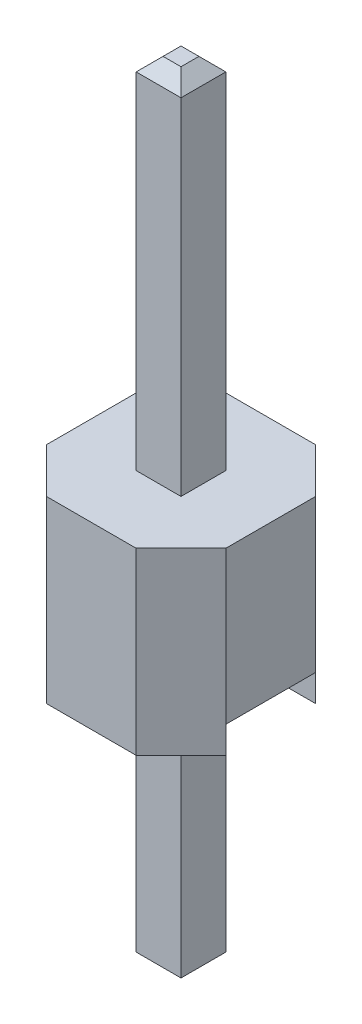
ISO-10303-21;
HEADER;
FILE_DESCRIPTION(('STEP AP214'),'2;1');
FILE_NAME('part.step','',(''),(''),'','','');
FILE_SCHEMA(('AUTOMOTIVE_DESIGN { 1 0 10303 214 1 1 1 1 }'));
ENDSEC;
DATA;
#1=APPLICATION_CONTEXT('core data for automotive mechanical design processes');
#2=APPLICATION_PROTOCOL_DEFINITION('international standard','automotive_design',2000,#1);
#3=PRODUCT_CONTEXT('',#1,'mechanical');
#4=PRODUCT('Part','Part','',(#3));
#5=PRODUCT_RELATED_PRODUCT_CATEGORY('part','',(#4));
#6=PRODUCT_DEFINITION_FORMATION('','',#4);
#7=PRODUCT_DEFINITION_CONTEXT('part definition',#1,'design');
#8=PRODUCT_DEFINITION('design','',#6,#7);
#9=PRODUCT_DEFINITION_SHAPE('','',#8);
#10=(LENGTH_UNIT() NAMED_UNIT(*) SI_UNIT(.MILLI.,.METRE.));
#11=(NAMED_UNIT(*) PLANE_ANGLE_UNIT() SI_UNIT($,.RADIAN.));
#12=(NAMED_UNIT(*) SI_UNIT($,.STERADIAN.) SOLID_ANGLE_UNIT());
#13=UNCERTAINTY_MEASURE_WITH_UNIT(LENGTH_MEASURE(1.E-05),#10,'distance_accuracy_value','');
#14=(GEOMETRIC_REPRESENTATION_CONTEXT(3) GLOBAL_UNCERTAINTY_ASSIGNED_CONTEXT((#13)) GLOBAL_UNIT_ASSIGNED_CONTEXT((#10,
#11,#12)) REPRESENTATION_CONTEXT('',''));
#15=CARTESIAN_POINT('',(0.,0.,0.));
#16=DIRECTION('',(0.,0.,1.));
#17=DIRECTION('',(1.,0.,0.));
#18=AXIS2_PLACEMENT_3D('',#15,#16,#17);
#19=CARTESIAN_POINT('',(-2.59591892663164,0.381,0.634999999999996));
#20=DIRECTION('',(0.,1.,0.));
#21=DIRECTION('',(0.,0.,1.));
#22=AXIS2_PLACEMENT_3D('',#19,#20,#21);
#23=PLANE('',#22);
#24=DIRECTION('',(0.,0.,-1.));
#25=VECTOR('',#24,1.);
#26=CARTESIAN_POINT('',(-1.27,0.381,0.635000000000008));
#27=LINE('',#26,#25);
#28=CARTESIAN_POINT('',(-1.27,0.381,0.634999999999998));
#29=VERTEX_POINT('',#28);
#30=CARTESIAN_POINT('',(-1.26999999999999,0.381,-0.635000000000004));
#31=VERTEX_POINT('',#30);
#32=EDGE_CURVE('E239',#29,#31,#27,.T.);
#33=ORIENTED_EDGE('',*,*,#32,.T.);
#34=DIRECTION('',(1.,0.,0.));
#35=VECTOR('',#34,1.);
#36=CARTESIAN_POINT('',(-2.59591892663164,0.381,-0.635000000000004));
#37=LINE('',#36,#35);
#38=CARTESIAN_POINT('',(1.27,0.381,-0.634999999999998));
#39=VERTEX_POINT('',#38);
#40=EDGE_CURVE('E247',#31,#39,#37,.T.);
#41=ORIENTED_EDGE('',*,*,#40,.T.);
#42=DIRECTION('',(0.,0.,1.));
#43=VECTOR('',#42,1.);
#44=CARTESIAN_POINT('',(1.27,0.381,0.635000000000002));
#45=LINE('',#44,#43);
#46=CARTESIAN_POINT('',(1.27,0.381,0.635000000000002));
#47=VERTEX_POINT('',#46);
#48=EDGE_CURVE('E242',#39,#47,#45,.T.);
#49=ORIENTED_EDGE('',*,*,#48,.T.);
#50=DIRECTION('',(1.,0.,0.));
#51=VECTOR('',#50,1.);
#52=CARTESIAN_POINT('',(-2.59591892663164,0.381,0.634999999999996));
#53=LINE('',#52,#51);
#54=EDGE_CURVE('E252',#29,#47,#53,.T.);
#55=ORIENTED_EDGE('',*,*,#54,.F.);
#56=EDGE_LOOP('',(#33,#41,#49,#55));
#57=FACE_BOUND('',#56,.T.);
#58=DIRECTION('',(0.,0.,1.));
#59=VECTOR('',#58,1.);
#60=CARTESIAN_POINT('',(0.3175,0.381,-0.3175));
#61=LINE('',#60,#59);
#62=CARTESIAN_POINT('',(0.3175,0.381,-0.3175));
#63=VERTEX_POINT('',#62);
#64=CARTESIAN_POINT('',(0.3175,0.381,0.3175));
#65=VERTEX_POINT('',#64);
#66=EDGE_CURVE('E184',#63,#65,#61,.T.);
#67=ORIENTED_EDGE('',*,*,#66,.F.);
#68=DIRECTION('',(1.,0.,0.));
#69=VECTOR('',#68,1.);
#70=CARTESIAN_POINT('',(-0.3175,0.381,-0.3175));
#71=LINE('',#70,#69);
#72=CARTESIAN_POINT('',(-0.3175,0.381,-0.3175));
#73=VERTEX_POINT('',#72);
#74=EDGE_CURVE('E189',#73,#63,#71,.T.);
#75=ORIENTED_EDGE('',*,*,#74,.F.);
#76=DIRECTION('',(0.,0.,-1.));
#77=VECTOR('',#76,1.);
#78=CARTESIAN_POINT('',(-0.3175,0.381,-0.3175));
#79=LINE('',#78,#77);
#80=CARTESIAN_POINT('',(-0.3175,0.381,0.3175));
#81=VERTEX_POINT('',#80);
#82=EDGE_CURVE('E201',#81,#73,#79,.T.);
#83=ORIENTED_EDGE('',*,*,#82,.F.);
#84=DIRECTION('',(-1.,0.,0.));
#85=VECTOR('',#84,1.);
#86=CARTESIAN_POINT('',(-0.3175,0.381,0.3175));
#87=LINE('',#86,#85);
#88=EDGE_CURVE('E197',#65,#81,#87,.T.);
#89=ORIENTED_EDGE('',*,*,#88,.F.);
#90=EDGE_LOOP('',(#67,#75,#83,#89));
#91=FACE_BOUND('',#90,.T.);
#92=ADVANCED_FACE('F34',(#57,#91),#23,.F.);
#93=CARTESIAN_POINT('',(0.,2.54,0.));
#94=DIRECTION('',(0.,1.,0.));
#95=DIRECTION('',(0.,0.,1.));
#96=AXIS2_PLACEMENT_3D('',#93,#94,#95);
#97=PLANE('',#96);
#98=DIRECTION('',(-1.,0.,0.));
#99=VECTOR('',#98,1.);
#100=CARTESIAN_POINT('',(-0.634999999999986,2.54,-1.27000000000001));
#101=LINE('',#100,#99);
#102=CARTESIAN_POINT('',(0.634999999999999,2.54,-1.27));
#103=VERTEX_POINT('',#102);
#104=CARTESIAN_POINT('',(-0.634999999999986,2.54,-1.27000000000001));
#105=VERTEX_POINT('',#104);
#106=EDGE_CURVE('E257',#103,#105,#101,.T.);
#107=ORIENTED_EDGE('',*,*,#106,.T.);
#108=DIRECTION('',(-0.707106781186555,0.,0.70710678118654));
#109=VECTOR('',#108,1.);
#110=CARTESIAN_POINT('',(-1.26999999999999,2.54,-0.635000000000013));
#111=LINE('',#110,#109);
#112=CARTESIAN_POINT('',(-1.26999999999999,2.54,-0.635000000000013));
#113=VERTEX_POINT('',#112);
#114=EDGE_CURVE('E260',#105,#113,#111,.T.);
#115=ORIENTED_EDGE('',*,*,#114,.T.);
#116=DIRECTION('',(0.,0.,1.));
#117=VECTOR('',#116,1.);
#118=CARTESIAN_POINT('',(-1.27,2.54,0.63499999999999));
#119=LINE('',#118,#117);
#120=CARTESIAN_POINT('',(-1.27,2.54,0.63499999999999));
#121=VERTEX_POINT('',#120);
#122=EDGE_CURVE('E263',#113,#121,#119,.T.);
#123=ORIENTED_EDGE('',*,*,#122,.T.);
#124=DIRECTION('',(0.707106781186542,0.,0.707106781186553));
#125=VECTOR('',#124,1.);
#126=CARTESIAN_POINT('',(-0.635000000000008,2.54,1.27));
#127=LINE('',#126,#125);
#128=CARTESIAN_POINT('',(-0.635000000000008,2.54,1.27));
#129=VERTEX_POINT('',#128);
#130=EDGE_CURVE('E265',#121,#129,#127,.T.);
#131=ORIENTED_EDGE('',*,*,#130,.T.);
#132=DIRECTION('',(1.,0.,0.));
#133=VECTOR('',#132,1.);
#134=CARTESIAN_POINT('',(-0.635000000000008,2.54,1.27));
#135=LINE('',#134,#133);
#136=CARTESIAN_POINT('',(0.634999999999995,2.54,1.27));
#137=VERTEX_POINT('',#136);
#138=EDGE_CURVE('E267',#129,#137,#135,.T.);
#139=ORIENTED_EDGE('',*,*,#138,.T.);
#140=DIRECTION('',(0.70710678118655,0.,-0.707106781186545));
#141=VECTOR('',#140,1.);
#142=CARTESIAN_POINT('',(1.27,2.54,0.635000000000004));
#143=LINE('',#142,#141);
#144=CARTESIAN_POINT('',(1.27,2.54,0.635000000000004));
#145=VERTEX_POINT('',#144);
#146=EDGE_CURVE('E269',#137,#145,#143,.T.);
#147=ORIENTED_EDGE('',*,*,#146,.T.);
#148=DIRECTION('',(0.,0.,-1.));
#149=VECTOR('',#148,1.);
#150=CARTESIAN_POINT('',(1.27,2.54,0.635000000000004));
#151=LINE('',#150,#149);
#152=CARTESIAN_POINT('',(1.27,2.54,-0.634999999999999));
#153=VERTEX_POINT('',#152);
#154=EDGE_CURVE('E271',#145,#153,#151,.T.);
#155=ORIENTED_EDGE('',*,*,#154,.T.);
#156=DIRECTION('',(-0.707106781186548,0.,-0.707106781186548));
#157=VECTOR('',#156,1.);
#158=CARTESIAN_POINT('',(0.634999999999999,2.54,-1.27));
#159=LINE('',#158,#157);
#160=EDGE_CURVE('E273',#153,#103,#159,.T.);
#161=ORIENTED_EDGE('',*,*,#160,.T.);
#162=EDGE_LOOP('',(#107,#115,#123,#131,#139,#147,#155,#161));
#163=FACE_BOUND('',#162,.T.);
#164=DIRECTION('',(-1.,0.,0.));
#165=VECTOR('',#164,1.);
#166=CARTESIAN_POINT('',(-0.3175,2.54,-0.3175));
#167=LINE('',#166,#165);
#168=CARTESIAN_POINT('',(0.3175,2.54,-0.3175));
#169=VERTEX_POINT('',#168);
#170=CARTESIAN_POINT('',(-0.3175,2.54,-0.3175));
#171=VERTEX_POINT('',#170);
#172=EDGE_CURVE('E215',#169,#171,#167,.T.);
#173=ORIENTED_EDGE('',*,*,#172,.F.);
#174=DIRECTION('',(0.,0.,-1.));
#175=VECTOR('',#174,1.);
#176=CARTESIAN_POINT('',(0.3175,2.54,0.3175));
#177=LINE('',#176,#175);
#178=CARTESIAN_POINT('',(0.3175,2.54,0.3175));
#179=VERTEX_POINT('',#178);
#180=EDGE_CURVE('E212',#179,#169,#177,.T.);
#181=ORIENTED_EDGE('',*,*,#180,.F.);
#182=DIRECTION('',(1.,0.,0.));
#183=VECTOR('',#182,1.);
#184=CARTESIAN_POINT('',(-0.3175,2.54,0.3175));
#185=LINE('',#184,#183);
#186=CARTESIAN_POINT('',(-0.3175,2.54,0.3175));
#187=VERTEX_POINT('',#186);
#188=EDGE_CURVE('E222',#187,#179,#185,.T.);
#189=ORIENTED_EDGE('',*,*,#188,.F.);
#190=DIRECTION('',(0.,0.,1.));
#191=VECTOR('',#190,1.);
#192=CARTESIAN_POINT('',(-0.3175,2.54,0.3175));
#193=LINE('',#192,#191);
#194=EDGE_CURVE('E219',#171,#187,#193,.T.);
#195=ORIENTED_EDGE('',*,*,#194,.F.);
#196=EDGE_LOOP('',(#173,#181,#189,#195));
#197=FACE_BOUND('',#196,.T.);
#198=ADVANCED_FACE('F387',(#163,#197),#97,.T.);
#199=CARTESIAN_POINT('',(0.,0.,0.));
#200=DIRECTION('',(0.,1.,0.));
#201=DIRECTION('',(0.,0.,1.));
#202=AXIS2_PLACEMENT_3D('',#199,#200,#201);
#203=PLANE('',#202);
#204=DIRECTION('',(-0.707106781186548,0.,-0.707106781186548));
#205=VECTOR('',#204,1.);
#206=CARTESIAN_POINT('',(0.634999999999999,0.,-1.27));
#207=LINE('',#206,#205);
#208=CARTESIAN_POINT('',(1.27,0.,-0.634999999999999));
#209=VERTEX_POINT('',#208);
#210=CARTESIAN_POINT('',(0.634999999999999,0.,-1.27));
#211=VERTEX_POINT('',#210);
#212=EDGE_CURVE('E261',#209,#211,#207,.T.);
#213=ORIENTED_EDGE('',*,*,#212,.F.);
#214=DIRECTION('',(1.,0.,0.));
#215=VECTOR('',#214,1.);
#216=CARTESIAN_POINT('',(-2.59591892663164,0.,-0.635000000000005));
#217=LINE('',#216,#215);
#218=CARTESIAN_POINT('',(-1.26999999999999,0.,-0.635000000000006));
#219=VERTEX_POINT('',#218);
#220=EDGE_CURVE('E237',#219,#209,#217,.T.);
#221=ORIENTED_EDGE('',*,*,#220,.F.);
#222=DIRECTION('',(-0.707106781186555,0.,0.70710678118654));
#223=VECTOR('',#222,1.);
#224=CARTESIAN_POINT('',(-1.26999999999999,0.,-0.635000000000013));
#225=LINE('',#224,#223);
#226=CARTESIAN_POINT('',(-0.634999999999986,0.,-1.27000000000001));
#227=VERTEX_POINT('',#226);
#228=EDGE_CURVE('E278',#227,#219,#225,.T.);
#229=ORIENTED_EDGE('',*,*,#228,.F.);
#230=DIRECTION('',(-1.,0.,0.));
#231=VECTOR('',#230,1.);
#232=CARTESIAN_POINT('',(-0.634999999999986,0.,-1.27000000000001));
#233=LINE('',#232,#231);
#234=EDGE_CURVE('E256',#211,#227,#233,.T.);
#235=ORIENTED_EDGE('',*,*,#234,.F.);
#236=EDGE_LOOP('',(#213,#221,#229,#235));
#237=FACE_BOUND('',#236,.T.);
#238=ADVANCED_FACE('F393',(#237),#203,.F.);
#239=CARTESIAN_POINT('',(-0.634999999999986,2.54,-1.27000000000001));
#240=DIRECTION('',(0.,0.,1.));
#241=DIRECTION('',(1.,0.,0.));
#242=AXIS2_PLACEMENT_3D('',#239,#240,#241);
#243=PLANE('',#242);
#244=ORIENTED_EDGE('',*,*,#234,.T.);
#245=DIRECTION('',(0.,-1.,0.));
#246=VECTOR('',#245,1.);
#247=CARTESIAN_POINT('',(-0.634999999999986,2.54,-1.27000000000001));
#248=LINE('',#247,#246);
#249=EDGE_CURVE('E309',#105,#227,#248,.T.);
#250=ORIENTED_EDGE('',*,*,#249,.F.);
#251=ORIENTED_EDGE('',*,*,#106,.F.);
#252=DIRECTION('',(0.,-1.,0.));
#253=VECTOR('',#252,1.);
#254=CARTESIAN_POINT('',(0.634999999999999,2.54,-1.27));
#255=LINE('',#254,#253);
#256=EDGE_CURVE('E275',#103,#211,#255,.T.);
#257=ORIENTED_EDGE('',*,*,#256,.T.);
#258=EDGE_LOOP('',(#244,#250,#251,#257));
#259=FACE_BOUND('',#258,.T.);
#260=ADVANCED_FACE('F435',(#259),#243,.F.);
#261=CARTESIAN_POINT('',(-1.26999999999999,2.54,-0.635000000000013));
#262=DIRECTION('',(0.70710678118654,0.,0.707106781186555));
#263=DIRECTION('',(0.707106781186555,0.,-0.70710678118654));
#264=AXIS2_PLACEMENT_3D('',#261,#262,#263);
#265=PLANE('',#264);
#266=ORIENTED_EDGE('',*,*,#228,.T.);
#267=DIRECTION('',(0.,-1.,0.));
#268=VECTOR('',#267,1.);
#269=CARTESIAN_POINT('',(-1.26999999999999,0.,-0.635000000000003));
#270=LINE('',#269,#268);
#271=EDGE_CURVE('E236',#31,#219,#270,.T.);
#272=ORIENTED_EDGE('',*,*,#271,.F.);
#273=DIRECTION('',(0.,-1.,0.));
#274=VECTOR('',#273,1.);
#275=CARTESIAN_POINT('',(-1.26999999999999,2.54,-0.635000000000013));
#276=LINE('',#275,#274);
#277=EDGE_CURVE('E306',#113,#31,#276,.T.);
#278=ORIENTED_EDGE('',*,*,#277,.F.);
#279=ORIENTED_EDGE('',*,*,#114,.F.);
#280=ORIENTED_EDGE('',*,*,#249,.T.);
#281=EDGE_LOOP('',(#266,#272,#278,#279,#280));
#282=FACE_BOUND('',#281,.T.);
#283=ADVANCED_FACE('F431',(#282),#265,.F.);
#284=CARTESIAN_POINT('',(-1.27,2.54,0.63499999999999));
#285=DIRECTION('',(1.,0.,0.));
#286=DIRECTION('',(0.,0.,-1.));
#287=AXIS2_PLACEMENT_3D('',#284,#285,#286);
#288=PLANE('',#287);
#289=ORIENTED_EDGE('',*,*,#277,.T.);
#290=ORIENTED_EDGE('',*,*,#32,.F.);
#291=DIRECTION('',(0.,-1.,0.));
#292=VECTOR('',#291,1.);
#293=CARTESIAN_POINT('',(-1.27,2.54,0.63499999999999));
#294=LINE('',#293,#292);
#295=EDGE_CURVE('E303',#121,#29,#294,.T.);
#296=ORIENTED_EDGE('',*,*,#295,.F.);
#297=ORIENTED_EDGE('',*,*,#122,.F.);
#298=EDGE_LOOP('',(#289,#290,#296,#297));
#299=FACE_BOUND('',#298,.T.);
#300=ADVANCED_FACE('F427',(#299),#288,.F.);
#301=CARTESIAN_POINT('',(-0.635000000000008,2.54,1.27));
#302=DIRECTION('',(0.707106781186553,0.,-0.707106781186542));
#303=DIRECTION('',(-0.707106781186542,0.,-0.707106781186553));
#304=AXIS2_PLACEMENT_3D('',#301,#302,#303);
#305=PLANE('',#304);
#306=DIRECTION('',(0.707106781186542,0.,0.707106781186553));
#307=VECTOR('',#306,1.);
#308=CARTESIAN_POINT('',(-0.635000000000008,0.,1.27));
#309=LINE('',#308,#307);
#310=CARTESIAN_POINT('',(-1.27,0.,0.635));
#311=VERTEX_POINT('',#310);
#312=CARTESIAN_POINT('',(-0.635000000000008,0.,1.27));
#313=VERTEX_POINT('',#312);
#314=EDGE_CURVE('E281',#311,#313,#309,.T.);
#315=ORIENTED_EDGE('',*,*,#314,.T.);
#316=DIRECTION('',(0.,-1.,0.));
#317=VECTOR('',#316,1.);
#318=CARTESIAN_POINT('',(-0.635000000000008,2.54,1.27));
#319=LINE('',#318,#317);
#320=EDGE_CURVE('E300',#129,#313,#319,.T.);
#321=ORIENTED_EDGE('',*,*,#320,.F.);
#322=ORIENTED_EDGE('',*,*,#130,.F.);
#323=ORIENTED_EDGE('',*,*,#295,.T.);
#324=DIRECTION('',(0.,1.,0.));
#325=VECTOR('',#324,1.);
#326=CARTESIAN_POINT('',(-1.27,0.,0.635));
#327=LINE('',#326,#325);
#328=EDGE_CURVE('E234',#311,#29,#327,.T.);
#329=ORIENTED_EDGE('',*,*,#328,.F.);
#330=EDGE_LOOP('',(#315,#321,#322,#323,#329));
#331=FACE_BOUND('',#330,.T.);
#332=ADVANCED_FACE('F423',(#331),#305,.F.);
#333=CARTESIAN_POINT('',(-0.635000000000008,2.54,1.27));
#334=DIRECTION('',(0.,0.,-1.));
#335=DIRECTION('',(-1.,0.,0.));
#336=AXIS2_PLACEMENT_3D('',#333,#334,#335);
#337=PLANE('',#336);
#338=DIRECTION('',(1.,0.,0.));
#339=VECTOR('',#338,1.);
#340=CARTESIAN_POINT('',(-0.635000000000008,0.,1.27));
#341=LINE('',#340,#339);
#342=CARTESIAN_POINT('',(0.634999999999995,0.,1.27));
#343=VERTEX_POINT('',#342);
#344=EDGE_CURVE('E283',#313,#343,#341,.T.);
#345=ORIENTED_EDGE('',*,*,#344,.T.);
#346=DIRECTION('',(0.,-1.,0.));
#347=VECTOR('',#346,1.);
#348=CARTESIAN_POINT('',(0.634999999999995,2.54,1.27));
#349=LINE('',#348,#347);
#350=EDGE_CURVE('E297',#137,#343,#349,.T.);
#351=ORIENTED_EDGE('',*,*,#350,.F.);
#352=ORIENTED_EDGE('',*,*,#138,.F.);
#353=ORIENTED_EDGE('',*,*,#320,.T.);
#354=EDGE_LOOP('',(#345,#351,#352,#353));
#355=FACE_BOUND('',#354,.T.);
#356=ADVANCED_FACE('F419',(#355),#337,.F.);
#357=CARTESIAN_POINT('',(1.27,2.54,0.635000000000004));
#358=DIRECTION('',(-0.707106781186545,0.,-0.70710678118655));
#359=DIRECTION('',(-0.70710678118655,0.,0.707106781186545));
#360=AXIS2_PLACEMENT_3D('',#357,#358,#359);
#361=PLANE('',#360);
#362=DIRECTION('',(0.70710678118655,0.,-0.707106781186545));
#363=VECTOR('',#362,1.);
#364=CARTESIAN_POINT('',(1.27,0.,0.635000000000004));
#365=LINE('',#364,#363);
#366=CARTESIAN_POINT('',(1.27,0.,0.635000000000004));
#367=VERTEX_POINT('',#366);
#368=EDGE_CURVE('E285',#343,#367,#365,.T.);
#369=ORIENTED_EDGE('',*,*,#368,.T.);
#370=DIRECTION('',(0.,-1.,0.));
#371=VECTOR('',#370,1.);
#372=CARTESIAN_POINT('',(1.27,0.,0.635000000000004));
#373=LINE('',#372,#371);
#374=EDGE_CURVE('E245',#47,#367,#373,.T.);
#375=ORIENTED_EDGE('',*,*,#374,.F.);
#376=DIRECTION('',(0.,-1.,0.));
#377=VECTOR('',#376,1.);
#378=CARTESIAN_POINT('',(1.27,2.54,0.635000000000004));
#379=LINE('',#378,#377);
#380=EDGE_CURVE('E294',#145,#47,#379,.T.);
#381=ORIENTED_EDGE('',*,*,#380,.F.);
#382=ORIENTED_EDGE('',*,*,#146,.F.);
#383=ORIENTED_EDGE('',*,*,#350,.T.);
#384=EDGE_LOOP('',(#369,#375,#381,#382,#383));
#385=FACE_BOUND('',#384,.T.);
#386=ADVANCED_FACE('F415',(#385),#361,.F.);
#387=CARTESIAN_POINT('',(1.27,2.54,0.635000000000004));
#388=DIRECTION('',(-1.,0.,0.));
#389=DIRECTION('',(0.,0.,1.));
#390=AXIS2_PLACEMENT_3D('',#387,#388,#389);
#391=PLANE('',#390);
#392=ORIENTED_EDGE('',*,*,#380,.T.);
#393=ORIENTED_EDGE('',*,*,#48,.F.);
#394=DIRECTION('',(0.,-1.,0.));
#395=VECTOR('',#394,1.);
#396=CARTESIAN_POINT('',(1.27,2.54,-0.634999999999999));
#397=LINE('',#396,#395);
#398=EDGE_CURVE('E291',#153,#39,#397,.T.);
#399=ORIENTED_EDGE('',*,*,#398,.F.);
#400=ORIENTED_EDGE('',*,*,#154,.F.);
#401=EDGE_LOOP('',(#392,#393,#399,#400));
#402=FACE_BOUND('',#401,.T.);
#403=ADVANCED_FACE('F411',(#402),#391,.F.);
#404=CARTESIAN_POINT('',(0.634999999999999,2.54,-1.27));
#405=DIRECTION('',(-0.707106781186548,0.,0.707106781186548));
#406=DIRECTION('',(0.707106781186548,0.,0.707106781186548));
#407=AXIS2_PLACEMENT_3D('',#404,#405,#406);
#408=PLANE('',#407);
#409=ORIENTED_EDGE('',*,*,#212,.T.);
#410=ORIENTED_EDGE('',*,*,#256,.F.);
#411=ORIENTED_EDGE('',*,*,#160,.F.);
#412=ORIENTED_EDGE('',*,*,#398,.T.);
#413=DIRECTION('',(0.,1.,0.));
#414=VECTOR('',#413,1.);
#415=CARTESIAN_POINT('',(1.27,0.,-0.634999999999999));
#416=LINE('',#415,#414);
#417=EDGE_CURVE('E233',#209,#39,#416,.T.);
#418=ORIENTED_EDGE('',*,*,#417,.F.);
#419=EDGE_LOOP('',(#409,#410,#411,#412,#418));
#420=FACE_BOUND('',#419,.T.);
#421=ADVANCED_FACE('F407',(#420),#408,.F.);
#422=ORIENTED_EDGE('',*,*,#314,.F.);
#423=DIRECTION('',(1.,0.,0.));
#424=VECTOR('',#423,1.);
#425=CARTESIAN_POINT('',(-2.59591892663164,0.,0.634999999999998));
#426=LINE('',#425,#424);
#427=EDGE_CURVE('E249',#311,#367,#426,.T.);
#428=ORIENTED_EDGE('',*,*,#427,.T.);
#429=ORIENTED_EDGE('',*,*,#368,.F.);
#430=ORIENTED_EDGE('',*,*,#344,.F.);
#431=EDGE_LOOP('',(#422,#428,#429,#430));
#432=FACE_BOUND('',#431,.T.);
#433=ADVANCED_FACE('F402',(#432),#203,.F.);
#434=CARTESIAN_POINT('',(-2.59591892663164,0.,-0.635000000000005));
#435=DIRECTION('',(0.,0.,-1.));
#436=DIRECTION('',(0.,1.,0.));
#437=AXIS2_PLACEMENT_3D('',#434,#435,#436);
#438=PLANE('',#437);
#439=ORIENTED_EDGE('',*,*,#271,.T.);
#440=ORIENTED_EDGE('',*,*,#220,.T.);
#441=ORIENTED_EDGE('',*,*,#417,.T.);
#442=ORIENTED_EDGE('',*,*,#40,.F.);
#443=EDGE_LOOP('',(#439,#440,#441,#442));
#444=FACE_BOUND('',#443,.T.);
#445=ADVANCED_FACE('F400',(#444),#438,.F.);
#446=CARTESIAN_POINT('',(-2.59591892663164,0.,0.634999999999998));
#447=DIRECTION('',(0.,0.,1.));
#448=DIRECTION('',(0.,-1.,0.));
#449=AXIS2_PLACEMENT_3D('',#446,#447,#448);
#450=PLANE('',#449);
#451=ORIENTED_EDGE('',*,*,#328,.T.);
#452=ORIENTED_EDGE('',*,*,#54,.T.);
#453=ORIENTED_EDGE('',*,*,#374,.T.);
#454=ORIENTED_EDGE('',*,*,#427,.F.);
#455=EDGE_LOOP('',(#451,#452,#453,#454));
#456=FACE_BOUND('',#455,.T.);
#457=ADVANCED_FACE('F398',(#456),#450,.F.);
#458=CARTESIAN_POINT('',(0.3175,7.62,0.3175));
#459=DIRECTION('',(-1.,0.,0.));
#460=DIRECTION('',(0.,0.,1.));
#461=AXIS2_PLACEMENT_3D('',#458,#459,#460);
#462=PLANE('',#461);
#463=DIRECTION('',(0.,-1.,0.));
#464=VECTOR('',#463,1.);
#465=CARTESIAN_POINT('',(0.3175,7.62,-0.3175));
#466=LINE('',#465,#464);
#467=CARTESIAN_POINT('',(0.3175,7.4295,-0.3175));
#468=VERTEX_POINT('',#467);
#469=EDGE_CURVE('E231',#468,#169,#466,.T.);
#470=ORIENTED_EDGE('',*,*,#469,.F.);
#471=DIRECTION('',(0.,0.,1.));
#472=VECTOR('',#471,1.);
#473=CARTESIAN_POINT('',(0.3175,7.4295,0.3175));
#474=LINE('',#473,#472);
#475=CARTESIAN_POINT('',(0.3175,7.4295,0.3175));
#476=VERTEX_POINT('',#475);
#477=EDGE_CURVE('E324',#468,#476,#474,.T.);
#478=ORIENTED_EDGE('',*,*,#477,.T.);
#479=DIRECTION('',(0.,-1.,0.));
#480=VECTOR('',#479,1.);
#481=CARTESIAN_POINT('',(0.3175,7.62,0.3175));
#482=LINE('',#481,#480);
#483=EDGE_CURVE('E225',#476,#179,#482,.T.);
#484=ORIENTED_EDGE('',*,*,#483,.T.);
#485=ORIENTED_EDGE('',*,*,#180,.T.);
#486=EDGE_LOOP('',(#470,#478,#484,#485));
#487=FACE_BOUND('',#486,.T.);
#488=ADVANCED_FACE('F524',(#487),#462,.F.);
#489=CARTESIAN_POINT('',(-0.3175,7.62,-0.3175));
#490=DIRECTION('',(0.,0.,1.));
#491=DIRECTION('',(1.,0.,0.));
#492=AXIS2_PLACEMENT_3D('',#489,#490,#491);
#493=PLANE('',#492);
#494=DIRECTION('',(0.,-1.,0.));
#495=VECTOR('',#494,1.);
#496=CARTESIAN_POINT('',(-0.3175,7.62,-0.3175));
#497=LINE('',#496,#495);
#498=CARTESIAN_POINT('',(-0.3175,7.4295,-0.3175));
#499=VERTEX_POINT('',#498);
#500=EDGE_CURVE('E229',#499,#171,#497,.T.);
#501=ORIENTED_EDGE('',*,*,#500,.F.);
#502=DIRECTION('',(1.,0.,0.));
#503=VECTOR('',#502,1.);
#504=CARTESIAN_POINT('',(-0.3175,7.4295,-0.3175));
#505=LINE('',#504,#503);
#506=EDGE_CURVE('E321',#499,#468,#505,.T.);
#507=ORIENTED_EDGE('',*,*,#506,.T.);
#508=ORIENTED_EDGE('',*,*,#469,.T.);
#509=ORIENTED_EDGE('',*,*,#172,.T.);
#510=EDGE_LOOP('',(#501,#507,#508,#509));
#511=FACE_BOUND('',#510,.T.);
#512=ADVANCED_FACE('F512',(#511),#493,.F.);
#513=CARTESIAN_POINT('',(-0.3175,7.62,0.3175));
#514=DIRECTION('',(1.,0.,0.));
#515=DIRECTION('',(0.,0.,-1.));
#516=AXIS2_PLACEMENT_3D('',#513,#514,#515);
#517=PLANE('',#516);
#518=DIRECTION('',(0.,-1.,0.));
#519=VECTOR('',#518,1.);
#520=CARTESIAN_POINT('',(-0.3175,7.62,0.3175));
#521=LINE('',#520,#519);
#522=CARTESIAN_POINT('',(-0.3175,7.4295,0.3175));
#523=VERTEX_POINT('',#522);
#524=EDGE_CURVE('E227',#523,#187,#521,.T.);
#525=ORIENTED_EDGE('',*,*,#524,.F.);
#526=DIRECTION('',(0.,0.,-1.));
#527=VECTOR('',#526,1.);
#528=CARTESIAN_POINT('',(-0.3175,7.4295,0.3175));
#529=LINE('',#528,#527);
#530=EDGE_CURVE('E326',#523,#499,#529,.T.);
#531=ORIENTED_EDGE('',*,*,#530,.T.);
#532=ORIENTED_EDGE('',*,*,#500,.T.);
#533=ORIENTED_EDGE('',*,*,#194,.T.);
#534=EDGE_LOOP('',(#525,#531,#532,#533));
#535=FACE_BOUND('',#534,.T.);
#536=ADVANCED_FACE('F506',(#535),#517,.F.);
#537=CARTESIAN_POINT('',(-0.3175,7.62,0.3175));
#538=DIRECTION('',(0.,0.,-1.));
#539=DIRECTION('',(-1.,0.,0.));
#540=AXIS2_PLACEMENT_3D('',#537,#538,#539);
#541=PLANE('',#540);
#542=ORIENTED_EDGE('',*,*,#483,.F.);
#543=DIRECTION('',(-1.,0.,0.));
#544=VECTOR('',#543,1.);
#545=CARTESIAN_POINT('',(-0.3175,7.4295,0.3175));
#546=LINE('',#545,#544);
#547=EDGE_CURVE('E328',#476,#523,#546,.T.);
#548=ORIENTED_EDGE('',*,*,#547,.T.);
#549=ORIENTED_EDGE('',*,*,#524,.T.);
#550=ORIENTED_EDGE('',*,*,#188,.T.);
#551=EDGE_LOOP('',(#542,#548,#549,#550));
#552=FACE_BOUND('',#551,.T.);
#553=ADVANCED_FACE('F511',(#552),#541,.F.);
#554=CARTESIAN_POINT('',(0.,7.62,0.));
#555=DIRECTION('',(0.,-1.,0.));
#556=DIRECTION('',(0.,0.,-1.));
#557=AXIS2_PLACEMENT_3D('',#554,#555,#556);
#558=PLANE('',#557);
#559=DIRECTION('',(0.,0.,-1.));
#560=VECTOR('',#559,1.);
#561=CARTESIAN_POINT('',(0.127000000000001,7.62,0.));
#562=LINE('',#561,#560);
#563=CARTESIAN_POINT('',(0.127000000000001,7.62,0.127000000000001));
#564=VERTEX_POINT('',#563);
#565=CARTESIAN_POINT('',(0.127000000000001,7.62,-0.127000000000001));
#566=VERTEX_POINT('',#565);
#567=EDGE_CURVE('E316',#564,#566,#562,.T.);
#568=ORIENTED_EDGE('',*,*,#567,.T.);
#569=DIRECTION('',(-1.,0.,0.));
#570=VECTOR('',#569,1.);
#571=CARTESIAN_POINT('',(0.,7.62,-0.127000000000001));
#572=LINE('',#571,#570);
#573=CARTESIAN_POINT('',(-0.127000000000001,7.62,-0.127000000000001));
#574=VERTEX_POINT('',#573);
#575=EDGE_CURVE('E318',#566,#574,#572,.T.);
#576=ORIENTED_EDGE('',*,*,#575,.T.);
#577=DIRECTION('',(0.,0.,1.));
#578=VECTOR('',#577,1.);
#579=CARTESIAN_POINT('',(-0.127000000000001,7.62,0.));
#580=LINE('',#579,#578);
#581=CARTESIAN_POINT('',(-0.127000000000001,7.62,0.127000000000001));
#582=VERTEX_POINT('',#581);
#583=EDGE_CURVE('E314',#574,#582,#580,.T.);
#584=ORIENTED_EDGE('',*,*,#583,.T.);
#585=DIRECTION('',(1.,0.,0.));
#586=VECTOR('',#585,1.);
#587=CARTESIAN_POINT('',(0.,7.62,0.127000000000001));
#588=LINE('',#587,#586);
#589=EDGE_CURVE('E312',#582,#564,#588,.T.);
#590=ORIENTED_EDGE('',*,*,#589,.T.);
#591=EDGE_LOOP('',(#568,#576,#584,#590));
#592=FACE_BOUND('',#591,.T.);
#593=ADVANCED_FACE('F455',(#592),#558,.F.);
#594=CARTESIAN_POINT('',(0.,7.62,0.127000000000001));
#595=DIRECTION('',(0.,-0.707106781186546,-0.707106781186549));
#596=DIRECTION('',(1.,0.,0.));
#597=AXIS2_PLACEMENT_3D('',#594,#595,#596);
#598=PLANE('',#597);
#599=DIRECTION('',(-0.577350269189625,-0.577350269189628,0.577350269189625));
#600=VECTOR('',#599,1.);
#601=CARTESIAN_POINT('',(-0.0846666666666676,7.66233333333333,0.0846666666666676));
#602=LINE('',#601,#600);
#603=EDGE_CURVE('E334',#523,#582,#602,.F.);
#604=ORIENTED_EDGE('',*,*,#603,.F.);
#605=ORIENTED_EDGE('',*,*,#547,.F.);
#606=DIRECTION('',(-0.577350269189625,0.577350269189628,-0.577350269189625));
#607=VECTOR('',#606,1.);
#608=CARTESIAN_POINT('',(0.0846666666666676,7.66233333333333,0.0846666666666676));
#609=LINE('',#608,#607);
#610=EDGE_CURVE('E216',#564,#476,#609,.F.);
#611=ORIENTED_EDGE('',*,*,#610,.F.);
#612=ORIENTED_EDGE('',*,*,#589,.F.);
#613=EDGE_LOOP('',(#604,#605,#611,#612));
#614=FACE_BOUND('',#613,.T.);
#615=ADVANCED_FACE('F451',(#614),#598,.F.);
#616=CARTESIAN_POINT('',(0.127000000000001,7.62,0.));
#617=DIRECTION('',(-0.707106781186549,-0.707106781186546,0.));
#618=DIRECTION('',(0.,0.,-1.));
#619=AXIS2_PLACEMENT_3D('',#616,#617,#618);
#620=PLANE('',#619);
#621=ORIENTED_EDGE('',*,*,#610,.T.);
#622=ORIENTED_EDGE('',*,*,#477,.F.);
#623=DIRECTION('',(-0.577350269189625,0.577350269189628,0.577350269189625));
#624=VECTOR('',#623,1.);
#625=CARTESIAN_POINT('',(0.0846666666666676,7.66233333333333,-0.0846666666666676));
#626=LINE('',#625,#624);
#627=EDGE_CURVE('E332',#566,#468,#626,.F.);
#628=ORIENTED_EDGE('',*,*,#627,.F.);
#629=ORIENTED_EDGE('',*,*,#567,.F.);
#630=EDGE_LOOP('',(#621,#622,#628,#629));
#631=FACE_BOUND('',#630,.T.);
#632=ADVANCED_FACE('F447',(#631),#620,.F.);
#633=CARTESIAN_POINT('',(-0.127000000000001,7.62,0.));
#634=DIRECTION('',(0.707106781186549,-0.707106781186546,0.));
#635=DIRECTION('',(0.,0.,1.));
#636=AXIS2_PLACEMENT_3D('',#633,#634,#635);
#637=PLANE('',#636);
#638=ORIENTED_EDGE('',*,*,#603,.T.);
#639=ORIENTED_EDGE('',*,*,#583,.F.);
#640=DIRECTION('',(-0.577350269189625,-0.577350269189628,-0.577350269189625));
#641=VECTOR('',#640,1.);
#642=CARTESIAN_POINT('',(-0.0846666666666676,7.66233333333333,-0.0846666666666676));
#643=LINE('',#642,#641);
#644=EDGE_CURVE('E211',#499,#574,#643,.F.);
#645=ORIENTED_EDGE('',*,*,#644,.F.);
#646=ORIENTED_EDGE('',*,*,#530,.F.);
#647=EDGE_LOOP('',(#638,#639,#645,#646));
#648=FACE_BOUND('',#647,.T.);
#649=ADVANCED_FACE('F443',(#648),#637,.F.);
#650=CARTESIAN_POINT('',(0.,7.62,-0.127000000000001));
#651=DIRECTION('',(0.,-0.707106781186546,0.707106781186549));
#652=DIRECTION('',(-1.,0.,0.));
#653=AXIS2_PLACEMENT_3D('',#650,#651,#652);
#654=PLANE('',#653);
#655=ORIENTED_EDGE('',*,*,#627,.T.);
#656=ORIENTED_EDGE('',*,*,#506,.F.);
#657=ORIENTED_EDGE('',*,*,#644,.T.);
#658=ORIENTED_EDGE('',*,*,#575,.F.);
#659=EDGE_LOOP('',(#655,#656,#657,#658));
#660=FACE_BOUND('',#659,.T.);
#661=ADVANCED_FACE('F440',(#660),#654,.F.);
#662=CARTESIAN_POINT('',(0.3175,-3.556,-0.3175));
#663=DIRECTION('',(-1.,0.,0.));
#664=DIRECTION('',(0.,0.,1.));
#665=AXIS2_PLACEMENT_3D('',#662,#663,#664);
#666=PLANE('',#665);
#667=DIRECTION('',(0.,1.,0.));
#668=VECTOR('',#667,1.);
#669=CARTESIAN_POINT('',(0.3175,-3.556,0.3175));
#670=LINE('',#669,#668);
#671=CARTESIAN_POINT('',(0.3175,-3.3655,0.3175));
#672=VERTEX_POINT('',#671);
#673=EDGE_CURVE('E209',#672,#65,#670,.T.);
#674=ORIENTED_EDGE('',*,*,#673,.F.);
#675=DIRECTION('',(0.,0.,-1.));
#676=VECTOR('',#675,1.);
#677=CARTESIAN_POINT('',(0.3175,-3.3655,-0.3175));
#678=LINE('',#677,#676);
#679=CARTESIAN_POINT('',(0.3175,-3.3655,-0.3175));
#680=VERTEX_POINT('',#679);
#681=EDGE_CURVE('E43',#672,#680,#678,.T.);
#682=ORIENTED_EDGE('',*,*,#681,.T.);
#683=DIRECTION('',(0.,1.,0.));
#684=VECTOR('',#683,1.);
#685=CARTESIAN_POINT('',(0.3175,-3.556,-0.3175));
#686=LINE('',#685,#684);
#687=EDGE_CURVE('E181',#680,#63,#686,.T.);
#688=ORIENTED_EDGE('',*,*,#687,.T.);
#689=ORIENTED_EDGE('',*,*,#66,.T.);
#690=EDGE_LOOP('',(#674,#682,#688,#689));
#691=FACE_BOUND('',#690,.T.);
#692=ADVANCED_FACE('F183',(#691),#666,.F.);
#693=CARTESIAN_POINT('',(-0.3175,-3.556,0.3175));
#694=DIRECTION('',(0.,0.,-1.));
#695=DIRECTION('',(-1.,0.,0.));
#696=AXIS2_PLACEMENT_3D('',#693,#694,#695);
#697=PLANE('',#696);
#698=DIRECTION('',(0.,1.,0.));
#699=VECTOR('',#698,1.);
#700=CARTESIAN_POINT('',(-0.3175,-3.556,0.3175));
#701=LINE('',#700,#699);
#702=CARTESIAN_POINT('',(-0.3175,-3.3655,0.3175));
#703=VERTEX_POINT('',#702);
#704=EDGE_CURVE('E207',#703,#81,#701,.T.);
#705=ORIENTED_EDGE('',*,*,#704,.F.);
#706=DIRECTION('',(1.,0.,0.));
#707=VECTOR('',#706,1.);
#708=CARTESIAN_POINT('',(-0.3175,-3.3655,0.3175));
#709=LINE('',#708,#707);
#710=EDGE_CURVE('E11',#703,#672,#709,.T.);
#711=ORIENTED_EDGE('',*,*,#710,.T.);
#712=ORIENTED_EDGE('',*,*,#673,.T.);
#713=ORIENTED_EDGE('',*,*,#88,.T.);
#714=EDGE_LOOP('',(#705,#711,#712,#713));
#715=FACE_BOUND('',#714,.T.);
#716=ADVANCED_FACE('F483',(#715),#697,.F.);
#717=CARTESIAN_POINT('',(-0.3175,-3.556,-0.3175));
#718=DIRECTION('',(1.,0.,0.));
#719=DIRECTION('',(0.,0.,-1.));
#720=AXIS2_PLACEMENT_3D('',#717,#718,#719);
#721=PLANE('',#720);
#722=DIRECTION('',(0.,1.,0.));
#723=VECTOR('',#722,1.);
#724=CARTESIAN_POINT('',(-0.3175,-3.556,-0.3175));
#725=LINE('',#724,#723);
#726=CARTESIAN_POINT('',(-0.3175,-3.3655,-0.3175));
#727=VERTEX_POINT('',#726);
#728=EDGE_CURVE('E188',#727,#73,#725,.T.);
#729=ORIENTED_EDGE('',*,*,#728,.F.);
#730=DIRECTION('',(0.,0.,1.));
#731=VECTOR('',#730,1.);
#732=CARTESIAN_POINT('',(-0.3175,-3.3655,-0.3175));
#733=LINE('',#732,#731);
#734=EDGE_CURVE('E347',#727,#703,#733,.T.);
#735=ORIENTED_EDGE('',*,*,#734,.T.);
#736=ORIENTED_EDGE('',*,*,#704,.T.);
#737=ORIENTED_EDGE('',*,*,#82,.T.);
#738=EDGE_LOOP('',(#729,#735,#736,#737));
#739=FACE_BOUND('',#738,.T.);
#740=ADVANCED_FACE('F373',(#739),#721,.F.);
#741=CARTESIAN_POINT('',(-0.3175,-3.556,-0.3175));
#742=DIRECTION('',(0.,0.,1.));
#743=DIRECTION('',(1.,0.,0.));
#744=AXIS2_PLACEMENT_3D('',#741,#742,#743);
#745=PLANE('',#744);
#746=ORIENTED_EDGE('',*,*,#687,.F.);
#747=DIRECTION('',(-1.,0.,0.));
#748=VECTOR('',#747,1.);
#749=CARTESIAN_POINT('',(-0.3175,-3.3655,-0.3175));
#750=LINE('',#749,#748);
#751=EDGE_CURVE('E350',#680,#727,#750,.T.);
#752=ORIENTED_EDGE('',*,*,#751,.T.);
#753=ORIENTED_EDGE('',*,*,#728,.T.);
#754=ORIENTED_EDGE('',*,*,#74,.T.);
#755=EDGE_LOOP('',(#746,#752,#753,#754));
#756=FACE_BOUND('',#755,.T.);
#757=ADVANCED_FACE('F199',(#756),#745,.F.);
#758=CARTESIAN_POINT('',(0.,-3.556,0.));
#759=DIRECTION('',(0.,1.,0.));
#760=DIRECTION('',(0.,0.,1.));
#761=AXIS2_PLACEMENT_3D('',#758,#759,#760);
#762=PLANE('',#761);
#763=DIRECTION('',(-1.,0.,0.));
#764=VECTOR('',#763,1.);
#765=CARTESIAN_POINT('',(0.,-3.556,0.127000000000002));
#766=LINE('',#765,#764);
#767=CARTESIAN_POINT('',(0.127000000000002,-3.556,0.127000000000002));
#768=VERTEX_POINT('',#767);
#769=CARTESIAN_POINT('',(-0.127000000000002,-3.556,0.127000000000002));
#770=VERTEX_POINT('',#769);
#771=EDGE_CURVE('E330',#768,#770,#766,.T.);
#772=ORIENTED_EDGE('',*,*,#771,.T.);
#773=DIRECTION('',(0.,0.,-1.));
#774=VECTOR('',#773,1.);
#775=CARTESIAN_POINT('',(-0.127000000000002,-3.556,0.));
#776=LINE('',#775,#774);
#777=CARTESIAN_POINT('',(-0.127000000000002,-3.556,-0.127000000000002));
#778=VERTEX_POINT('',#777);
#779=EDGE_CURVE('E344',#770,#778,#776,.T.);
#780=ORIENTED_EDGE('',*,*,#779,.T.);
#781=DIRECTION('',(1.,0.,0.));
#782=VECTOR('',#781,1.);
#783=CARTESIAN_POINT('',(0.,-3.556,-0.127000000000002));
#784=LINE('',#783,#782);
#785=CARTESIAN_POINT('',(0.127000000000002,-3.556,-0.127000000000002));
#786=VERTEX_POINT('',#785);
#787=EDGE_CURVE('E342',#778,#786,#784,.T.);
#788=ORIENTED_EDGE('',*,*,#787,.T.);
#789=DIRECTION('',(0.,0.,1.));
#790=VECTOR('',#789,1.);
#791=CARTESIAN_POINT('',(0.127000000000002,-3.556,0.));
#792=LINE('',#791,#790);
#793=EDGE_CURVE('E340',#786,#768,#792,.T.);
#794=ORIENTED_EDGE('',*,*,#793,.T.);
#795=EDGE_LOOP('',(#772,#780,#788,#794));
#796=FACE_BOUND('',#795,.T.);
#797=ADVANCED_FACE('F378',(#796),#762,.F.);
#798=CARTESIAN_POINT('',(0.127000000000002,-3.556,0.));
#799=DIRECTION('',(-0.707106781186547,0.707106781186547,0.));
#800=DIRECTION('',(0.,0.,1.));
#801=AXIS2_PLACEMENT_3D('',#798,#799,#800);
#802=PLANE('',#801);
#803=DIRECTION('',(0.577350269189626,0.577350269189626,-0.577350269189626));
#804=VECTOR('',#803,1.);
#805=CARTESIAN_POINT('',(0.0846666666666681,-3.59833333333333,-0.084666666666668));
#806=LINE('',#805,#804);
#807=EDGE_CURVE('E356',#680,#786,#806,.F.);
#808=ORIENTED_EDGE('',*,*,#807,.F.);
#809=ORIENTED_EDGE('',*,*,#681,.F.);
#810=DIRECTION('',(0.577350269189626,0.577350269189626,0.577350269189626));
#811=VECTOR('',#810,1.);
#812=CARTESIAN_POINT('',(0.084666666666668,-3.59833333333333,0.0846666666666681));
#813=LINE('',#812,#811);
#814=EDGE_CURVE('E38',#768,#672,#813,.T.);
#815=ORIENTED_EDGE('',*,*,#814,.F.);
#816=ORIENTED_EDGE('',*,*,#793,.F.);
#817=EDGE_LOOP('',(#808,#809,#815,#816));
#818=FACE_BOUND('',#817,.T.);
#819=ADVANCED_FACE('F36',(#818),#802,.F.);
#820=CARTESIAN_POINT('',(0.,-3.556,0.127000000000002));
#821=DIRECTION('',(0.,0.707106781186547,-0.707106781186547));
#822=DIRECTION('',(-1.,0.,0.));
#823=AXIS2_PLACEMENT_3D('',#820,#821,#822);
#824=PLANE('',#823);
#825=ORIENTED_EDGE('',*,*,#814,.T.);
#826=ORIENTED_EDGE('',*,*,#710,.F.);
#827=DIRECTION('',(0.577350269189626,-0.577350269189626,-0.577350269189626));
#828=VECTOR('',#827,1.);
#829=CARTESIAN_POINT('',(-0.084666666666668,-3.59833333333333,0.0846666666666681));
#830=LINE('',#829,#828);
#831=EDGE_CURVE('E355',#770,#703,#830,.F.);
#832=ORIENTED_EDGE('',*,*,#831,.F.);
#833=ORIENTED_EDGE('',*,*,#771,.F.);
#834=EDGE_LOOP('',(#825,#826,#832,#833));
#835=FACE_BOUND('',#834,.T.);
#836=ADVANCED_FACE('F365',(#835),#824,.F.);
#837=CARTESIAN_POINT('',(0.,-3.556,-0.127000000000002));
#838=DIRECTION('',(0.,0.707106781186547,0.707106781186547));
#839=DIRECTION('',(1.,0.,0.));
#840=AXIS2_PLACEMENT_3D('',#837,#838,#839);
#841=PLANE('',#840);
#842=ORIENTED_EDGE('',*,*,#807,.T.);
#843=ORIENTED_EDGE('',*,*,#787,.F.);
#844=DIRECTION('',(-0.577350269189626,0.577350269189626,-0.577350269189626));
#845=VECTOR('',#844,1.);
#846=CARTESIAN_POINT('',(-0.084666666666668,-3.59833333333333,-0.084666666666668));
#847=LINE('',#846,#845);
#848=EDGE_CURVE('E353',#727,#778,#847,.F.);
#849=ORIENTED_EDGE('',*,*,#848,.F.);
#850=ORIENTED_EDGE('',*,*,#751,.F.);
#851=EDGE_LOOP('',(#842,#843,#849,#850));
#852=FACE_BOUND('',#851,.T.);
#853=ADVANCED_FACE('F370',(#852),#841,.F.);
#854=CARTESIAN_POINT('',(-0.127000000000002,-3.556,0.));
#855=DIRECTION('',(0.707106781186547,0.707106781186547,0.));
#856=DIRECTION('',(0.,0.,-1.));
#857=AXIS2_PLACEMENT_3D('',#854,#855,#856);
#858=PLANE('',#857);
#859=ORIENTED_EDGE('',*,*,#831,.T.);
#860=ORIENTED_EDGE('',*,*,#734,.F.);
#861=ORIENTED_EDGE('',*,*,#848,.T.);
#862=ORIENTED_EDGE('',*,*,#779,.F.);
#863=EDGE_LOOP('',(#859,#860,#861,#862));
#864=FACE_BOUND('',#863,.T.);
#865=ADVANCED_FACE('F375',(#864),#858,.F.);
#866=CLOSED_SHELL('',(#92,#198,#238,#260,#283,#300,#332,#356,#386,#403,#421,#433,#445,#457,#488,
#512,#536,#553,#593,#615,#632,#649,#661,#692,#716,#740,#757,#797,#819,#836,#853,#865));
#867=MANIFOLD_SOLID_BREP('B2',#866);
#868=ADVANCED_BREP_SHAPE_REPRESENTATION('',(#18,#867),#14);
#869=SHAPE_DEFINITION_REPRESENTATION(#9,#868);
ENDSEC;
END-ISO-10303-21;
